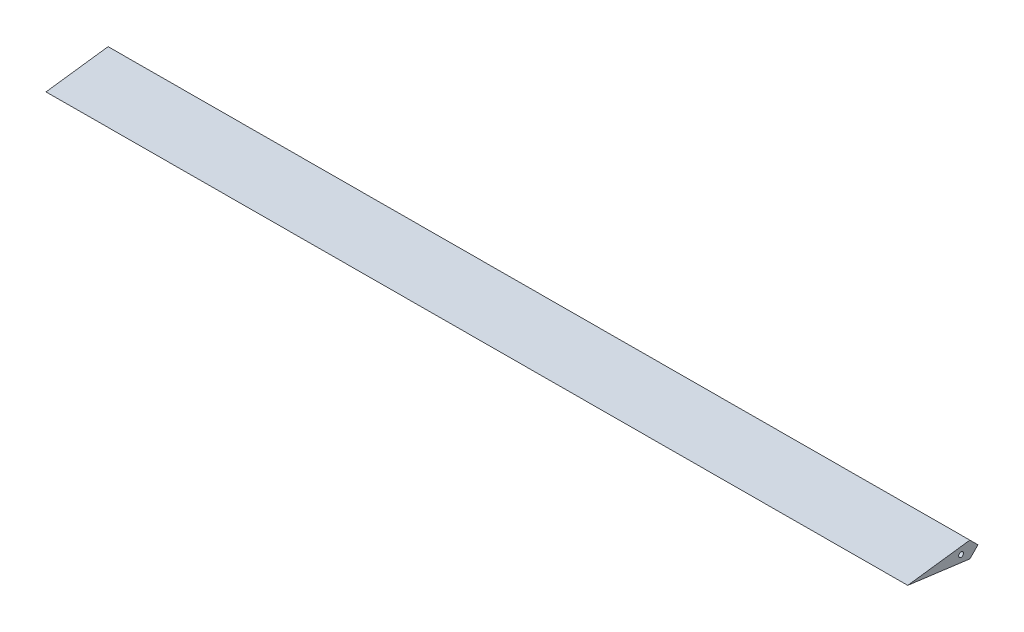
ISO-10303-21;
HEADER;
FILE_DESCRIPTION(('STEP AP214'),'2;1');
FILE_NAME('part.step','',(''),(''),'','','');
FILE_SCHEMA(('AUTOMOTIVE_DESIGN { 1 0 10303 214 1 1 1 1 }'));
ENDSEC;
DATA;
#1=APPLICATION_CONTEXT('core data for automotive mechanical design processes');
#2=APPLICATION_PROTOCOL_DEFINITION('international standard','automotive_design',2000,#1);
#3=PRODUCT_CONTEXT('',#1,'mechanical');
#4=PRODUCT('Part','Part','',(#3));
#5=PRODUCT_RELATED_PRODUCT_CATEGORY('part','',(#4));
#6=PRODUCT_DEFINITION_FORMATION('','',#4);
#7=PRODUCT_DEFINITION_CONTEXT('part definition',#1,'design');
#8=PRODUCT_DEFINITION('design','',#6,#7);
#9=PRODUCT_DEFINITION_SHAPE('','',#8);
#10=(LENGTH_UNIT() NAMED_UNIT(*) SI_UNIT(.MILLI.,.METRE.));
#11=(NAMED_UNIT(*) PLANE_ANGLE_UNIT() SI_UNIT($,.RADIAN.));
#12=(NAMED_UNIT(*) SI_UNIT($,.STERADIAN.) SOLID_ANGLE_UNIT());
#13=UNCERTAINTY_MEASURE_WITH_UNIT(LENGTH_MEASURE(1.E-05),#10,'distance_accuracy_value','');
#14=(GEOMETRIC_REPRESENTATION_CONTEXT(3) GLOBAL_UNCERTAINTY_ASSIGNED_CONTEXT((#13)) GLOBAL_UNIT_ASSIGNED_CONTEXT((#10,
#11,#12)) REPRESENTATION_CONTEXT('',''));
#15=CARTESIAN_POINT('',(0.,0.,0.));
#16=DIRECTION('',(0.,0.,1.));
#17=DIRECTION('',(1.,0.,0.));
#18=AXIS2_PLACEMENT_3D('',#15,#16,#17);
#19=CARTESIAN_POINT('',(482.691977653507,-10.4928743975499,-81.9835626101573));
#20=DIRECTION('',(-0.000534412245564587,0.991507677347762,-0.130047069032707));
#21=DIRECTION('',(0.,-0.130047087603201,-0.991507818933328));
#22=AXIS2_PLACEMENT_3D('',#19,#20,#21);
#23=PLANE('',#22);
#24=DIRECTION('',(0.,0.130047087603201,0.991507818933328));
#25=VECTOR('',#24,1.);
#26=CARTESIAN_POINT('',(482.691977653507,-10.4928743975499,-81.9835626101573));
#27=LINE('',#26,#25);
#28=CARTESIAN_POINT('',(482.691977653507,-9.16023701057422,-71.8232398121496));
#29=VERTEX_POINT('',#28);
#30=CARTESIAN_POINT('',(482.691977653507,0.,-1.9835626101573));
#31=VERTEX_POINT('',#30);
#32=EDGE_CURVE('E88',#29,#31,#27,.T.);
#33=ORIENTED_EDGE('',*,*,#32,.T.);
#34=DIRECTION('',(-0.99999155662324,0.,0.00410934085093643));
#35=VECTOR('',#34,1.);
#36=CARTESIAN_POINT('',(482.691977653507,0.,-1.9835626101573));
#37=LINE('',#36,#35);
#38=CARTESIAN_POINT('',(-482.691977653507,0.,1.9835626101573));
#39=VERTEX_POINT('',#38);
#40=EDGE_CURVE('E102',#31,#39,#37,.T.);
#41=ORIENTED_EDGE('',*,*,#40,.T.);
#42=DIRECTION('',(0.,0.130047087603201,0.991507818933328));
#43=VECTOR('',#42,1.);
#44=CARTESIAN_POINT('',(-482.691977653507,-10.4928743975499,-78.0164373898427));
#45=LINE('',#44,#43);
#46=CARTESIAN_POINT('',(-482.691977653507,-9.16023701057421,-67.856114591835));
#47=VERTEX_POINT('',#46);
#48=EDGE_CURVE('E94',#47,#39,#45,.T.);
#49=ORIENTED_EDGE('',*,*,#48,.F.);
#50=DIRECTION('',(-0.99999155662324,0.,0.00410934085093643));
#51=VECTOR('',#50,1.);
#52=CARTESIAN_POINT('',(482.73372953051,-9.16023701057422,-71.823411386292));
#53=LINE('',#52,#51);
#54=EDGE_CURVE('E90',#29,#47,#53,.T.);
#55=ORIENTED_EDGE('',*,*,#54,.F.);
#56=EDGE_LOOP('',(#33,#41,#49,#55));
#57=FACE_BOUND('',#56,.T.);
#58=ADVANCED_FACE('F37',(#57),#23,.F.);
#59=CARTESIAN_POINT('',(482.691977653507,10.4928743975499,-81.9835626101573));
#60=DIRECTION('',(-0.000534412245564587,-0.991507677347762,-0.130047069032707));
#61=DIRECTION('',(0.,-0.130047087603201,0.991507818933328));
#62=AXIS2_PLACEMENT_3D('',#59,#60,#61);
#63=PLANE('',#62);
#64=DIRECTION('',(0.,0.130047087603201,-0.991507818933328));
#65=VECTOR('',#64,1.);
#66=CARTESIAN_POINT('',(-482.691977653507,10.4928743975499,-78.0164373898427));
#67=LINE('',#66,#65);
#68=CARTESIAN_POINT('',(-482.691977653507,9.16023701057422,-67.856114591835));
#69=VERTEX_POINT('',#68);
#70=EDGE_CURVE('E97',#39,#69,#67,.T.);
#71=ORIENTED_EDGE('',*,*,#70,.F.);
#72=ORIENTED_EDGE('',*,*,#40,.F.);
#73=DIRECTION('',(0.,0.130047087603201,-0.991507818933328));
#74=VECTOR('',#73,1.);
#75=CARTESIAN_POINT('',(482.691977653507,10.4928743975499,-81.9835626101573));
#76=LINE('',#75,#74);
#77=CARTESIAN_POINT('',(482.691977653507,9.16023701057422,-71.8232398121496));
#78=VERTEX_POINT('',#77);
#79=EDGE_CURVE('E59',#31,#78,#76,.T.);
#80=ORIENTED_EDGE('',*,*,#79,.T.);
#81=DIRECTION('',(0.99999155662324,0.,-0.00410934085093643));
#82=VECTOR('',#81,1.);
#83=CARTESIAN_POINT('',(482.73372953051,9.16023701057422,-71.823411386292));
#84=LINE('',#83,#82);
#85=EDGE_CURVE('E89',#69,#78,#84,.T.);
#86=ORIENTED_EDGE('',*,*,#85,.F.);
#87=EDGE_LOOP('',(#71,#72,#80,#86));
#88=FACE_BOUND('',#87,.T.);
#89=ADVANCED_FACE('F121',(#88),#63,.F.);
#90=CARTESIAN_POINT('',(482.691977653507,0.,-1.9835626101573));
#91=DIRECTION('',(1.,0.,0.));
#92=DIRECTION('',(0.,0.,1.));
#93=AXIS2_PLACEMENT_3D('',#90,#91,#92);
#94=PLANE('',#93);
#95=DIRECTION('',(0.,0.707103795983158,0.707109766377335));
#96=VECTOR('',#95,1.);
#97=CARTESIAN_POINT('',(482.691977653507,39.499995776868,-41.4832248736784));
#98=LINE('',#97,#96);
#99=CARTESIAN_POINT('',(482.691977653507,0.,-80.9835541667093));
#100=VERTEX_POINT('',#99);
#101=EDGE_CURVE('E85',#100,#78,#98,.T.);
#102=ORIENTED_EDGE('',*,*,#101,.T.);
#103=ORIENTED_EDGE('',*,*,#79,.F.);
#104=ORIENTED_EDGE('',*,*,#32,.F.);
#105=DIRECTION('',(0.,0.707103795983158,-0.707109766377334));
#106=VECTOR('',#105,1.);
#107=CARTESIAN_POINT('',(482.691977653507,-39.499995776868,-41.4832248736785));
#108=LINE('',#107,#106);
#109=EDGE_CURVE('E79',#29,#100,#108,.T.);
#110=ORIENTED_EDGE('',*,*,#109,.T.);
#111=EDGE_LOOP('',(#102,#103,#104,#110));
#112=FACE_BOUND('',#111,.T.);
#113=CARTESIAN_POINT('',(482.691977653507,0.,-61.9840692170404));
#114=DIRECTION('',(-1.,0.,0.));
#115=DIRECTION('',(0.,0.,1.));
#116=AXIS2_PLACEMENT_3D('',#113,#114,#115);
#117=ELLIPSE('',#116,2.75002321948214,2.75);
#118=CARTESIAN_POINT('',(482.691977653507,0.,-59.2340459975582));
#119=VERTEX_POINT('',#118);
#120=EDGE_CURVE('E109',#119,#119,#117,.T.);
#121=ORIENTED_EDGE('',*,*,#120,.T.);
#122=EDGE_LOOP('',(#121));
#123=FACE_BOUND('',#122,.T.);
#124=ADVANCED_FACE('F83',(#112,#123),#94,.T.);
#125=CARTESIAN_POINT('',(-482.691977653507,0.,1.9835626101573));
#126=DIRECTION('',(1.,0.,0.));
#127=DIRECTION('',(0.,0.,1.));
#128=AXIS2_PLACEMENT_3D('',#125,#126,#127);
#129=PLANE('',#128);
#130=CARTESIAN_POINT('',(-482.691977653507,0.,-58.0169439967258));
#131=DIRECTION('',(-1.,0.,0.));
#132=DIRECTION('',(0.,0.,1.));
#133=AXIS2_PLACEMENT_3D('',#130,#131,#132);
#134=ELLIPSE('',#133,2.75002321948214,2.75);
#135=CARTESIAN_POINT('',(-482.691977653507,0.,-55.2669207772436));
#136=VERTEX_POINT('',#135);
#137=EDGE_CURVE('E81',#136,#136,#134,.T.);
#138=ORIENTED_EDGE('',*,*,#137,.F.);
#139=EDGE_LOOP('',(#138));
#140=FACE_BOUND('',#139,.T.);
#141=DIRECTION('',(0.,0.707103795983158,-0.707109766377334));
#142=VECTOR('',#141,1.);
#143=CARTESIAN_POINT('',(-482.691977653507,-39.499995776868,-37.5160996533639));
#144=LINE('',#143,#142);
#145=CARTESIAN_POINT('',(-482.691977653507,0.,-77.0164289463947));
#146=VERTEX_POINT('',#145);
#147=EDGE_CURVE('E44',#47,#146,#144,.T.);
#148=ORIENTED_EDGE('',*,*,#147,.F.);
#149=ORIENTED_EDGE('',*,*,#48,.T.);
#150=ORIENTED_EDGE('',*,*,#70,.T.);
#151=DIRECTION('',(0.,0.707103795983158,0.707109766377335));
#152=VECTOR('',#151,1.);
#153=CARTESIAN_POINT('',(-482.691977653507,39.499995776868,-37.5160996533639));
#154=LINE('',#153,#152);
#155=EDGE_CURVE('E11',#146,#69,#154,.T.);
#156=ORIENTED_EDGE('',*,*,#155,.F.);
#157=EDGE_LOOP('',(#148,#149,#150,#156));
#158=FACE_BOUND('',#157,.T.);
#159=ADVANCED_FACE('F119',(#140,#158),#129,.F.);
#160=CARTESIAN_POINT('',(482.774161694789,0.,-61.98440694213));
#161=DIRECTION('',(-0.99999155662324,0.,0.00410934085093643));
#162=DIRECTION('',(-0.00410934085093643,0.,-0.99999155662324));
#163=AXIS2_PLACEMENT_3D('',#160,#161,#162);
#164=CYLINDRICAL_SURFACE('',#163,2.75);
#165=ORIENTED_EDGE('',*,*,#120,.F.);
#166=EDGE_LOOP('',(#165));
#167=FACE_BOUND('',#166,.T.);
#168=ORIENTED_EDGE('',*,*,#137,.T.);
#169=EDGE_LOOP('',(#168));
#170=FACE_BOUND('',#169,.T.);
#171=ADVANCED_FACE('F130',(#167,#170),#164,.F.);
#172=CARTESIAN_POINT('',(482.739205791764,10.4928743975499,-70.4907852512758));
#173=DIRECTION('',(0.00290574278190403,-0.707106781186552,0.70710081081758));
#174=DIRECTION('',(0.,0.707103795983158,0.707109766377335));
#175=AXIS2_PLACEMENT_3D('',#172,#173,#174);
#176=PLANE('',#175);
#177=ORIENTED_EDGE('',*,*,#101,.F.);
#178=DIRECTION('',(-0.99999155662324,0.,0.00410934085093643));
#179=VECTOR('',#178,1.);
#180=CARTESIAN_POINT('',(482.696086994358,0.,-80.9835710535341));
#181=LINE('',#180,#179);
#182=EDGE_CURVE('E50',#100,#146,#181,.T.);
#183=ORIENTED_EDGE('',*,*,#182,.T.);
#184=ORIENTED_EDGE('',*,*,#155,.T.);
#185=ORIENTED_EDGE('',*,*,#85,.T.);
#186=EDGE_LOOP('',(#177,#183,#184,#185));
#187=FACE_BOUND('',#186,.T.);
#188=ADVANCED_FACE('F92',(#187),#176,.F.);
#189=CARTESIAN_POINT('',(482.696086994358,0.,-80.9835710535341));
#190=DIRECTION('',(0.00290574278190403,0.707106781186551,0.707100810817581));
#191=DIRECTION('',(0.,0.707103795983158,-0.707109766377334));
#192=AXIS2_PLACEMENT_3D('',#189,#190,#191);
#193=PLANE('',#192);
#194=ORIENTED_EDGE('',*,*,#109,.F.);
#195=ORIENTED_EDGE('',*,*,#54,.T.);
#196=ORIENTED_EDGE('',*,*,#147,.T.);
#197=ORIENTED_EDGE('',*,*,#182,.F.);
#198=EDGE_LOOP('',(#194,#195,#196,#197));
#199=FACE_BOUND('',#198,.T.);
#200=ADVANCED_FACE('F77',(#199),#193,.F.);
#201=CLOSED_SHELL('',(#58,#89,#124,#159,#171,#188,#200));
#202=MANIFOLD_SOLID_BREP('B2',#201);
#203=ADVANCED_BREP_SHAPE_REPRESENTATION('',(#18,#202),#14);
#204=SHAPE_DEFINITION_REPRESENTATION(#9,#203);
ENDSEC;
END-ISO-10303-21;
